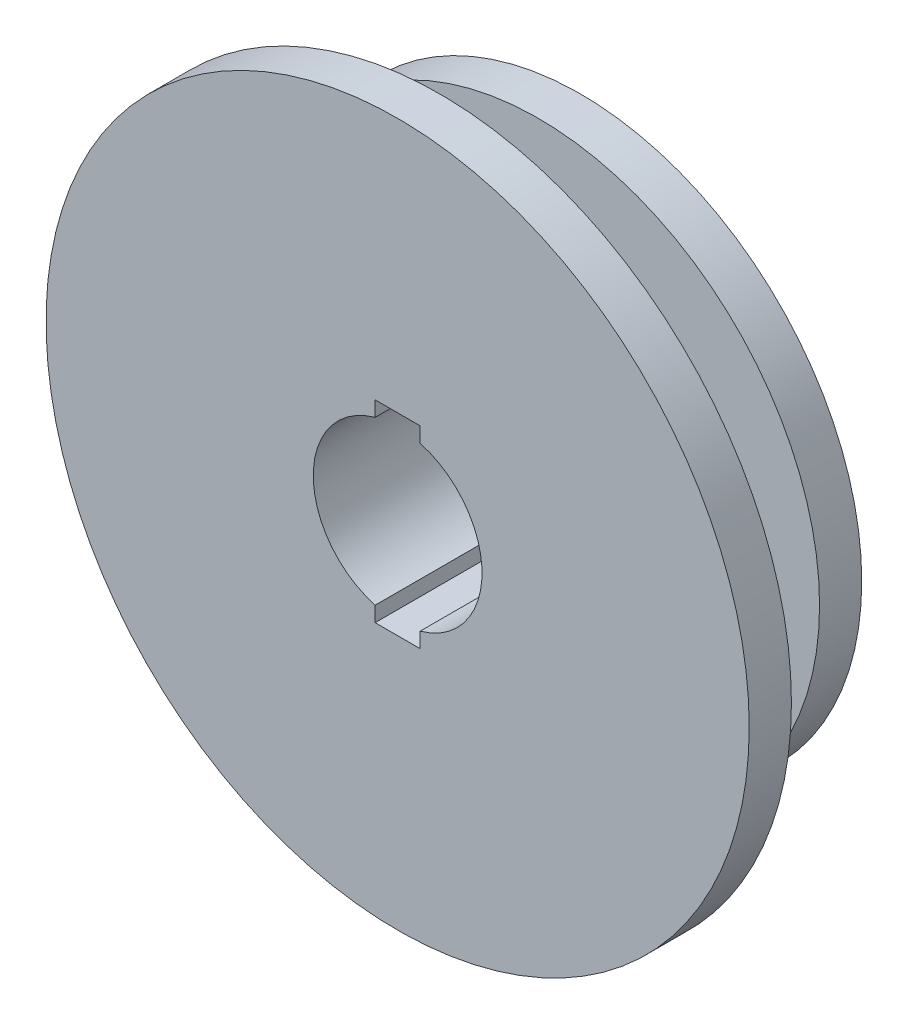
ISO-10303-21;
HEADER;
FILE_DESCRIPTION(('STEP AP214'),'2;1');
FILE_NAME('part.step','',(''),(''),'','','');
FILE_SCHEMA(('AUTOMOTIVE_DESIGN { 1 0 10303 214 1 1 1 1 }'));
ENDSEC;
DATA;
#1=APPLICATION_CONTEXT('core data for automotive mechanical design processes');
#2=APPLICATION_PROTOCOL_DEFINITION('international standard','automotive_design',2000,#1);
#3=PRODUCT_CONTEXT('',#1,'mechanical');
#4=PRODUCT('Part','Part','',(#3));
#5=PRODUCT_RELATED_PRODUCT_CATEGORY('part','',(#4));
#6=PRODUCT_DEFINITION_FORMATION('','',#4);
#7=PRODUCT_DEFINITION_CONTEXT('part definition',#1,'design');
#8=PRODUCT_DEFINITION('design','',#6,#7);
#9=PRODUCT_DEFINITION_SHAPE('','',#8);
#10=(LENGTH_UNIT() NAMED_UNIT(*) SI_UNIT(.MILLI.,.METRE.));
#11=(NAMED_UNIT(*) PLANE_ANGLE_UNIT() SI_UNIT($,.RADIAN.));
#12=(NAMED_UNIT(*) SI_UNIT($,.STERADIAN.) SOLID_ANGLE_UNIT());
#13=UNCERTAINTY_MEASURE_WITH_UNIT(LENGTH_MEASURE(1.E-05),#10,'distance_accuracy_value','');
#14=(GEOMETRIC_REPRESENTATION_CONTEXT(3) GLOBAL_UNCERTAINTY_ASSIGNED_CONTEXT((#13)) GLOBAL_UNIT_ASSIGNED_CONTEXT((#10,
#11,#12)) REPRESENTATION_CONTEXT('',''));
#15=CARTESIAN_POINT('',(0.,0.,0.));
#16=DIRECTION('',(0.,0.,1.));
#17=DIRECTION('',(1.,0.,0.));
#18=AXIS2_PLACEMENT_3D('',#15,#16,#17);
#19=CARTESIAN_POINT('',(0.,5.82449601570734,0.));
#20=DIRECTION('',(0.,0.,1.));
#21=DIRECTION('',(1.,0.,0.));
#22=AXIS2_PLACEMENT_3D('',#19,#20,#21);
#23=CYLINDRICAL_SURFACE('',#22,60.);
#24=DIRECTION('',(0.,0.,1.));
#25=VECTOR('',#24,1.);
#26=CARTESIAN_POINT('',(-16.,-52.0028331634965,-101.826733880455));
#27=LINE('',#26,#25);
#28=CARTESIAN_POINT('',(-16.,-52.0028331634965,-68.0578702566636));
#29=VERTEX_POINT('',#28);
#30=CARTESIAN_POINT('',(-16.,-52.0028331634965,31.9421297433364));
#31=VERTEX_POINT('',#30);
#32=EDGE_CURVE('E130',#29,#31,#27,.T.);
#33=ORIENTED_EDGE('',*,*,#32,.F.);
#34=CARTESIAN_POINT('',(0.,5.82449601570734,-68.0578702566636));
#35=DIRECTION('',(0.,0.,1.));
#36=DIRECTION('',(1.,0.,0.));
#37=AXIS2_PLACEMENT_3D('',#34,#35,#36);
#38=CIRCLE('',#37,60.);
#39=CARTESIAN_POINT('',(-16.,63.6518251949112,-68.0578702566636));
#40=VERTEX_POINT('',#39);
#41=EDGE_CURVE('E118',#40,#29,#38,.T.);
#42=ORIENTED_EDGE('',*,*,#41,.F.);
#43=DIRECTION('',(0.,0.,1.));
#44=VECTOR('',#43,1.);
#45=CARTESIAN_POINT('',(-16.,63.6518251949112,-101.826733880455));
#46=LINE('',#45,#44);
#47=CARTESIAN_POINT('',(-16.,63.6518251949112,31.9421297433364));
#48=VERTEX_POINT('',#47);
#49=EDGE_CURVE('E56',#40,#48,#46,.T.);
#50=ORIENTED_EDGE('',*,*,#49,.T.);
#51=CARTESIAN_POINT('',(0.,5.82449601570734,31.9421297433364));
#52=DIRECTION('',(0.,0.,1.));
#53=DIRECTION('',(1.,0.,0.));
#54=AXIS2_PLACEMENT_3D('',#51,#52,#53);
#55=CIRCLE('',#54,60.);
#56=EDGE_CURVE('E11',#48,#31,#55,.T.);
#57=ORIENTED_EDGE('',*,*,#56,.T.);
#58=EDGE_LOOP('',(#33,#42,#50,#57));
#59=FACE_BOUND('',#58,.T.);
#60=ADVANCED_FACE('F33',(#59),#23,.F.);
#61=CARTESIAN_POINT('',(16.,-52.0028331634965,-68.0578702566636));
#62=VERTEX_POINT('',#61);
#63=CARTESIAN_POINT('',(16.,63.6518251949112,-68.0578702566636));
#64=VERTEX_POINT('',#63);
#65=EDGE_CURVE('E150',#62,#64,#38,.T.);
#66=ORIENTED_EDGE('',*,*,#65,.F.);
#67=DIRECTION('',(0.,0.,1.));
#68=VECTOR('',#67,1.);
#69=CARTESIAN_POINT('',(16.,-52.0028331634965,-101.826733880455));
#70=LINE('',#69,#68);
#71=CARTESIAN_POINT('',(16.,-52.0028331634965,31.9421297433364));
#72=VERTEX_POINT('',#71);
#73=EDGE_CURVE('E48',#62,#72,#70,.T.);
#74=ORIENTED_EDGE('',*,*,#73,.T.);
#75=CARTESIAN_POINT('',(16.,63.6518251949112,31.9421297433364));
#76=VERTEX_POINT('',#75);
#77=EDGE_CURVE('E41',#72,#76,#55,.T.);
#78=ORIENTED_EDGE('',*,*,#77,.T.);
#79=DIRECTION('',(0.,0.,1.));
#80=VECTOR('',#79,1.);
#81=CARTESIAN_POINT('',(16.,63.6518251949112,-101.826733880455));
#82=LINE('',#81,#80);
#83=EDGE_CURVE('E119',#64,#76,#82,.T.);
#84=ORIENTED_EDGE('',*,*,#83,.F.);
#85=EDGE_LOOP('',(#66,#74,#78,#84));
#86=FACE_BOUND('',#85,.T.);
#87=ADVANCED_FACE('F35',(#86),#23,.F.);
#88=CARTESIAN_POINT('',(0.,65.8244960157073,31.9421297433364));
#89=DIRECTION('',(0.,0.,-1.));
#90=DIRECTION('',(-1.,0.,0.));
#91=AXIS2_PLACEMENT_3D('',#88,#89,#90);
#92=PLANE('',#91);
#93=ORIENTED_EDGE('',*,*,#77,.F.);
#94=DIRECTION('',(0.,1.,0.));
#95=VECTOR('',#94,1.);
#96=CARTESIAN_POINT('',(16.,11.6489920314147,31.9421297433364));
#97=LINE('',#96,#95);
#98=CARTESIAN_POINT('',(16.,-62.788756881113,31.9421297433364));
#99=VERTEX_POINT('',#98);
#100=EDGE_CURVE('E120',#99,#72,#97,.T.);
#101=ORIENTED_EDGE('',*,*,#100,.F.);
#102=DIRECTION('',(1.,0.,0.));
#103=VECTOR('',#102,1.);
#104=CARTESIAN_POINT('',(0.,-62.788756881113,31.9421297433364));
#105=LINE('',#104,#103);
#106=CARTESIAN_POINT('',(-16.,-62.788756881113,31.9421297433364));
#107=VERTEX_POINT('',#106);
#108=EDGE_CURVE('E200',#107,#99,#105,.T.);
#109=ORIENTED_EDGE('',*,*,#108,.F.);
#110=DIRECTION('',(0.,1.,0.));
#111=VECTOR('',#110,1.);
#112=CARTESIAN_POINT('',(-16.,11.6489920314147,31.9421297433364));
#113=LINE('',#112,#111);
#114=EDGE_CURVE('E105',#107,#31,#113,.T.);
#115=ORIENTED_EDGE('',*,*,#114,.T.);
#116=ORIENTED_EDGE('',*,*,#56,.F.);
#117=DIRECTION('',(0.,-1.,0.));
#118=VECTOR('',#117,1.);
#119=CARTESIAN_POINT('',(-16.,0.,31.9421297433364));
#120=LINE('',#119,#118);
#121=CARTESIAN_POINT('',(-16.,74.4377489125277,31.9421297433364));
#122=VERTEX_POINT('',#121);
#123=EDGE_CURVE('E133',#122,#48,#120,.T.);
#124=ORIENTED_EDGE('',*,*,#123,.F.);
#125=DIRECTION('',(-1.,0.,0.));
#126=VECTOR('',#125,1.);
#127=CARTESIAN_POINT('',(0.,74.4377489125277,31.9421297433364));
#128=LINE('',#127,#126);
#129=CARTESIAN_POINT('',(16.,74.4377489125277,31.9421297433364));
#130=VERTEX_POINT('',#129);
#131=EDGE_CURVE('E136',#130,#122,#128,.T.);
#132=ORIENTED_EDGE('',*,*,#131,.F.);
#133=DIRECTION('',(0.,-1.,0.));
#134=VECTOR('',#133,1.);
#135=CARTESIAN_POINT('',(16.,0.,31.9421297433364));
#136=LINE('',#135,#134);
#137=EDGE_CURVE('E139',#130,#76,#136,.T.);
#138=ORIENTED_EDGE('',*,*,#137,.T.);
#139=EDGE_LOOP('',(#93,#101,#109,#115,#116,#124,#132,#138));
#140=FACE_BOUND('',#139,.T.);
#141=CARTESIAN_POINT('',(0.,5.82449601570734,31.9421297433364));
#142=DIRECTION('',(0.,0.,1.));
#143=DIRECTION('',(1.,0.,0.));
#144=AXIS2_PLACEMENT_3D('',#141,#142,#143);
#145=CIRCLE('',#144,250.);
#146=CARTESIAN_POINT('',(250.,5.82449601570734,31.9421297433364));
#147=VERTEX_POINT('',#146);
#148=EDGE_CURVE('E177',#147,#147,#145,.T.);
#149=ORIENTED_EDGE('',*,*,#148,.T.);
#150=EDGE_LOOP('',(#149));
#151=FACE_BOUND('',#150,.T.);
#152=ADVANCED_FACE('F192',(#140,#151),#92,.F.);
#153=CARTESIAN_POINT('',(0.,5.82449601570734,0.));
#154=DIRECTION('',(0.,0.,1.));
#155=DIRECTION('',(1.,0.,0.));
#156=AXIS2_PLACEMENT_3D('',#153,#154,#155);
#157=CYLINDRICAL_SURFACE('',#156,250.);
#158=ORIENTED_EDGE('',*,*,#148,.F.);
#159=EDGE_LOOP('',(#158));
#160=FACE_BOUND('',#159,.T.);
#161=CARTESIAN_POINT('',(0.,5.82449601570734,1.94212974333642));
#162=DIRECTION('',(0.,0.,1.));
#163=DIRECTION('',(1.,0.,0.));
#164=AXIS2_PLACEMENT_3D('',#161,#162,#163);
#165=CIRCLE('',#164,250.);
#166=CARTESIAN_POINT('',(250.,5.82449601570734,1.94212974333642));
#167=VERTEX_POINT('',#166);
#168=EDGE_CURVE('E175',#167,#167,#165,.T.);
#169=ORIENTED_EDGE('',*,*,#168,.T.);
#170=EDGE_LOOP('',(#169));
#171=FACE_BOUND('',#170,.T.);
#172=ADVANCED_FACE('F210',(#160,#171),#157,.T.);
#173=CARTESIAN_POINT('',(0.,255.824496015707,1.94212974333641));
#174=DIRECTION('',(0.,0.,1.));
#175=DIRECTION('',(1.,0.,0.));
#176=AXIS2_PLACEMENT_3D('',#173,#174,#175);
#177=PLANE('',#176);
#178=ORIENTED_EDGE('',*,*,#168,.F.);
#179=EDGE_LOOP('',(#178));
#180=FACE_BOUND('',#179,.T.);
#181=CARTESIAN_POINT('',(0.,5.82449601570734,1.9421297433364));
#182=DIRECTION('',(0.,0.,1.));
#183=DIRECTION('',(1.,0.,0.));
#184=AXIS2_PLACEMENT_3D('',#181,#182,#183);
#185=CIRCLE('',#184,90.);
#186=CARTESIAN_POINT('',(90.,5.82449601570734,1.9421297433364));
#187=VERTEX_POINT('',#186);
#188=EDGE_CURVE('E172',#187,#187,#185,.T.);
#189=ORIENTED_EDGE('',*,*,#188,.T.);
#190=EDGE_LOOP('',(#189));
#191=FACE_BOUND('',#190,.T.);
#192=ADVANCED_FACE('F214',(#180,#191),#177,.F.);
#193=CARTESIAN_POINT('',(0.,5.82449601570734,0.));
#194=DIRECTION('',(0.,0.,1.));
#195=DIRECTION('',(1.,0.,0.));
#196=AXIS2_PLACEMENT_3D('',#193,#194,#195);
#197=CYLINDRICAL_SURFACE('',#196,90.);
#198=ORIENTED_EDGE('',*,*,#188,.F.);
#199=EDGE_LOOP('',(#198));
#200=FACE_BOUND('',#199,.T.);
#201=CARTESIAN_POINT('',(0.,5.82449601570734,-68.0578702566636));
#202=DIRECTION('',(0.,0.,1.));
#203=DIRECTION('',(1.,0.,0.));
#204=AXIS2_PLACEMENT_3D('',#201,#202,#203);
#205=CIRCLE('',#204,90.);
#206=CARTESIAN_POINT('',(90.,5.82449601570734,-68.0578702566636));
#207=VERTEX_POINT('',#206);
#208=EDGE_CURVE('E169',#207,#207,#205,.T.);
#209=ORIENTED_EDGE('',*,*,#208,.T.);
#210=EDGE_LOOP('',(#209));
#211=FACE_BOUND('',#210,.T.);
#212=ADVANCED_FACE('F220',(#200,#211),#197,.T.);
#213=CARTESIAN_POINT('',(0.,95.8244960157074,-68.0578702566636));
#214=DIRECTION('',(0.,0.,-1.));
#215=DIRECTION('',(-1.,0.,0.));
#216=AXIS2_PLACEMENT_3D('',#213,#214,#215);
#217=PLANE('',#216);
#218=ORIENTED_EDGE('',*,*,#208,.F.);
#219=EDGE_LOOP('',(#218));
#220=FACE_BOUND('',#219,.T.);
#221=CARTESIAN_POINT('',(0.,5.82449601570734,-68.0578702566636));
#222=DIRECTION('',(0.,0.,1.));
#223=DIRECTION('',(1.,0.,0.));
#224=AXIS2_PLACEMENT_3D('',#221,#222,#223);
#225=CIRCLE('',#224,200.);
#226=CARTESIAN_POINT('',(200.,5.82449601570734,-68.0578702566636));
#227=VERTEX_POINT('',#226);
#228=EDGE_CURVE('E166',#227,#227,#225,.T.);
#229=ORIENTED_EDGE('',*,*,#228,.T.);
#230=EDGE_LOOP('',(#229));
#231=FACE_BOUND('',#230,.T.);
#232=ADVANCED_FACE('F224',(#220,#231),#217,.F.);
#233=CARTESIAN_POINT('',(0.,5.82449601570734,0.));
#234=DIRECTION('',(0.,0.,1.));
#235=DIRECTION('',(1.,0.,0.));
#236=AXIS2_PLACEMENT_3D('',#233,#234,#235);
#237=CYLINDRICAL_SURFACE('',#236,200.);
#238=ORIENTED_EDGE('',*,*,#228,.F.);
#239=EDGE_LOOP('',(#238));
#240=FACE_BOUND('',#239,.T.);
#241=CARTESIAN_POINT('',(0.,5.82449601570734,-98.0578702566636));
#242=DIRECTION('',(0.,0.,1.));
#243=DIRECTION('',(1.,0.,0.));
#244=AXIS2_PLACEMENT_3D('',#241,#242,#243);
#245=CIRCLE('',#244,200.);
#246=CARTESIAN_POINT('',(200.,5.82449601570734,-98.0578702566636));
#247=VERTEX_POINT('',#246);
#248=EDGE_CURVE('E163',#247,#247,#245,.T.);
#249=ORIENTED_EDGE('',*,*,#248,.T.);
#250=EDGE_LOOP('',(#249));
#251=FACE_BOUND('',#250,.T.);
#252=ADVANCED_FACE('F228',(#240,#251),#237,.T.);
#253=CARTESIAN_POINT('',(0.,205.824496015707,-98.0578702566636));
#254=DIRECTION('',(0.,0.,1.));
#255=DIRECTION('',(1.,0.,0.));
#256=AXIS2_PLACEMENT_3D('',#253,#254,#255);
#257=PLANE('',#256);
#258=ORIENTED_EDGE('',*,*,#248,.F.);
#259=EDGE_LOOP('',(#258));
#260=FACE_BOUND('',#259,.T.);
#261=CARTESIAN_POINT('',(0.,5.82449601570734,-98.0578702566636));
#262=DIRECTION('',(0.,0.,1.));
#263=DIRECTION('',(1.,0.,0.));
#264=AXIS2_PLACEMENT_3D('',#261,#262,#263);
#265=CIRCLE('',#264,30.);
#266=CARTESIAN_POINT('',(30.,5.82449601570734,-98.0578702566636));
#267=VERTEX_POINT('',#266);
#268=EDGE_CURVE('E160',#267,#267,#265,.T.);
#269=ORIENTED_EDGE('',*,*,#268,.T.);
#270=EDGE_LOOP('',(#269));
#271=FACE_BOUND('',#270,.T.);
#272=ADVANCED_FACE('F232',(#260,#271),#257,.F.);
#273=CARTESIAN_POINT('',(0.,5.82449601570734,0.));
#274=DIRECTION('',(0.,0.,1.));
#275=DIRECTION('',(1.,0.,0.));
#276=AXIS2_PLACEMENT_3D('',#273,#274,#275);
#277=CYLINDRICAL_SURFACE('',#276,30.);
#278=ORIENTED_EDGE('',*,*,#268,.F.);
#279=EDGE_LOOP('',(#278));
#280=FACE_BOUND('',#279,.T.);
#281=CARTESIAN_POINT('',(0.,5.82449601570734,-68.0578702566636));
#282=DIRECTION('',(0.,0.,1.));
#283=DIRECTION('',(1.,0.,0.));
#284=AXIS2_PLACEMENT_3D('',#281,#282,#283);
#285=CIRCLE('',#284,30.);
#286=CARTESIAN_POINT('',(30.,5.82449601570734,-68.0578702566636));
#287=VERTEX_POINT('',#286);
#288=EDGE_CURVE('E157',#287,#287,#285,.T.);
#289=ORIENTED_EDGE('',*,*,#288,.T.);
#290=EDGE_LOOP('',(#289));
#291=FACE_BOUND('',#290,.T.);
#292=ADVANCED_FACE('F236',(#280,#291),#277,.F.);
#293=CARTESIAN_POINT('',(0.,65.8244960157073,-68.0578702566636));
#294=DIRECTION('',(0.,0.,-1.));
#295=DIRECTION('',(-1.,0.,0.));
#296=AXIS2_PLACEMENT_3D('',#293,#294,#295);
#297=PLANE('',#296);
#298=ORIENTED_EDGE('',*,*,#288,.F.);
#299=EDGE_LOOP('',(#298));
#300=FACE_BOUND('',#299,.T.);
#301=ORIENTED_EDGE('',*,*,#41,.T.);
#302=DIRECTION('',(0.,1.,0.));
#303=VECTOR('',#302,1.);
#304=CARTESIAN_POINT('',(-16.,11.6489920314147,-68.0578702566636));
#305=LINE('',#304,#303);
#306=CARTESIAN_POINT('',(-16.,-62.788756881113,-68.0578702566636));
#307=VERTEX_POINT('',#306);
#308=EDGE_CURVE('E102',#307,#29,#305,.T.);
#309=ORIENTED_EDGE('',*,*,#308,.F.);
#310=DIRECTION('',(1.,0.,0.));
#311=VECTOR('',#310,1.);
#312=CARTESIAN_POINT('',(0.,-62.788756881113,-68.0578702566636));
#313=LINE('',#312,#311);
#314=CARTESIAN_POINT('',(16.,-62.788756881113,-68.0578702566636));
#315=VERTEX_POINT('',#314);
#316=EDGE_CURVE('E115',#307,#315,#313,.T.);
#317=ORIENTED_EDGE('',*,*,#316,.T.);
#318=DIRECTION('',(0.,1.,0.));
#319=VECTOR('',#318,1.);
#320=CARTESIAN_POINT('',(16.,11.6489920314147,-68.0578702566636));
#321=LINE('',#320,#319);
#322=EDGE_CURVE('E125',#315,#62,#321,.T.);
#323=ORIENTED_EDGE('',*,*,#322,.T.);
#324=ORIENTED_EDGE('',*,*,#65,.T.);
#325=DIRECTION('',(0.,-1.,0.));
#326=VECTOR('',#325,1.);
#327=CARTESIAN_POINT('',(16.,0.,-68.0578702566636));
#328=LINE('',#327,#326);
#329=CARTESIAN_POINT('',(16.,74.4377489125277,-68.0578702566636));
#330=VERTEX_POINT('',#329);
#331=EDGE_CURVE('E135',#330,#64,#328,.T.);
#332=ORIENTED_EDGE('',*,*,#331,.F.);
#333=DIRECTION('',(-1.,0.,0.));
#334=VECTOR('',#333,1.);
#335=CARTESIAN_POINT('',(0.,74.4377489125277,-68.0578702566636));
#336=LINE('',#335,#334);
#337=CARTESIAN_POINT('',(-16.,74.4377489125277,-68.0578702566636));
#338=VERTEX_POINT('',#337);
#339=EDGE_CURVE('E143',#330,#338,#336,.T.);
#340=ORIENTED_EDGE('',*,*,#339,.T.);
#341=DIRECTION('',(0.,-1.,0.));
#342=VECTOR('',#341,1.);
#343=CARTESIAN_POINT('',(-16.,0.,-68.0578702566636));
#344=LINE('',#343,#342);
#345=EDGE_CURVE('E146',#338,#40,#344,.T.);
#346=ORIENTED_EDGE('',*,*,#345,.T.);
#347=EDGE_LOOP('',(#301,#309,#317,#323,#324,#332,#340,#346));
#348=FACE_BOUND('',#347,.T.);
#349=ADVANCED_FACE('F114',(#300,#348),#297,.F.);
#350=CARTESIAN_POINT('',(-16.,0.,-101.826733880455));
#351=DIRECTION('',(-1.,0.,0.));
#352=DIRECTION('',(0.,0.,1.));
#353=AXIS2_PLACEMENT_3D('',#350,#351,#352);
#354=PLANE('',#353);
#355=DIRECTION('',(0.,0.,1.));
#356=VECTOR('',#355,1.);
#357=CARTESIAN_POINT('',(-16.,74.4377489125277,-101.826733880455));
#358=LINE('',#357,#356);
#359=EDGE_CURVE('E145',#338,#122,#358,.T.);
#360=ORIENTED_EDGE('',*,*,#359,.T.);
#361=ORIENTED_EDGE('',*,*,#123,.T.);
#362=ORIENTED_EDGE('',*,*,#49,.F.);
#363=ORIENTED_EDGE('',*,*,#345,.F.);
#364=EDGE_LOOP('',(#360,#361,#362,#363));
#365=FACE_BOUND('',#364,.T.);
#366=ADVANCED_FACE('F243',(#365),#354,.F.);
#367=CARTESIAN_POINT('',(0.,74.4377489125277,-101.826733880455));
#368=DIRECTION('',(0.,1.,0.));
#369=DIRECTION('',(0.,0.,1.));
#370=AXIS2_PLACEMENT_3D('',#367,#368,#369);
#371=PLANE('',#370);
#372=DIRECTION('',(0.,0.,1.));
#373=VECTOR('',#372,1.);
#374=CARTESIAN_POINT('',(16.,74.4377489125277,-101.826733880455));
#375=LINE('',#374,#373);
#376=EDGE_CURVE('E142',#330,#130,#375,.T.);
#377=ORIENTED_EDGE('',*,*,#376,.T.);
#378=ORIENTED_EDGE('',*,*,#131,.T.);
#379=ORIENTED_EDGE('',*,*,#359,.F.);
#380=ORIENTED_EDGE('',*,*,#339,.F.);
#381=EDGE_LOOP('',(#377,#378,#379,#380));
#382=FACE_BOUND('',#381,.T.);
#383=ADVANCED_FACE('F197',(#382),#371,.F.);
#384=CARTESIAN_POINT('',(16.,0.,-101.826733880455));
#385=DIRECTION('',(-1.,0.,0.));
#386=DIRECTION('',(0.,0.,1.));
#387=AXIS2_PLACEMENT_3D('',#384,#385,#386);
#388=PLANE('',#387);
#389=ORIENTED_EDGE('',*,*,#331,.T.);
#390=ORIENTED_EDGE('',*,*,#83,.T.);
#391=ORIENTED_EDGE('',*,*,#137,.F.);
#392=ORIENTED_EDGE('',*,*,#376,.F.);
#393=EDGE_LOOP('',(#389,#390,#391,#392));
#394=FACE_BOUND('',#393,.T.);
#395=ADVANCED_FACE('F189',(#394),#388,.T.);
#396=CARTESIAN_POINT('',(16.,11.6489920314147,-101.826733880455));
#397=DIRECTION('',(1.,0.,0.));
#398=DIRECTION('',(0.,0.,-1.));
#399=AXIS2_PLACEMENT_3D('',#396,#397,#398);
#400=PLANE('',#399);
#401=DIRECTION('',(0.,0.,1.));
#402=VECTOR('',#401,1.);
#403=CARTESIAN_POINT('',(16.,-62.788756881113,-101.826733880455));
#404=LINE('',#403,#402);
#405=EDGE_CURVE('E110',#315,#99,#404,.T.);
#406=ORIENTED_EDGE('',*,*,#405,.T.);
#407=ORIENTED_EDGE('',*,*,#100,.T.);
#408=ORIENTED_EDGE('',*,*,#73,.F.);
#409=ORIENTED_EDGE('',*,*,#322,.F.);
#410=EDGE_LOOP('',(#406,#407,#408,#409));
#411=FACE_BOUND('',#410,.T.);
#412=ADVANCED_FACE('F199',(#411),#400,.F.);
#413=CARTESIAN_POINT('',(0.,-62.788756881113,-101.826733880455));
#414=DIRECTION('',(0.,-1.,0.));
#415=DIRECTION('',(0.,0.,-1.));
#416=AXIS2_PLACEMENT_3D('',#413,#414,#415);
#417=PLANE('',#416);
#418=DIRECTION('',(0.,0.,1.));
#419=VECTOR('',#418,1.);
#420=CARTESIAN_POINT('',(-16.,-62.788756881113,-101.826733880455));
#421=LINE('',#420,#419);
#422=EDGE_CURVE('E99',#307,#107,#421,.T.);
#423=ORIENTED_EDGE('',*,*,#422,.T.);
#424=ORIENTED_EDGE('',*,*,#108,.T.);
#425=ORIENTED_EDGE('',*,*,#405,.F.);
#426=ORIENTED_EDGE('',*,*,#316,.F.);
#427=EDGE_LOOP('',(#423,#424,#425,#426));
#428=FACE_BOUND('',#427,.T.);
#429=ADVANCED_FACE('F122',(#428),#417,.F.);
#430=CARTESIAN_POINT('',(-16.,11.6489920314147,-101.826733880455));
#431=DIRECTION('',(1.,0.,0.));
#432=DIRECTION('',(0.,0.,-1.));
#433=AXIS2_PLACEMENT_3D('',#430,#431,#432);
#434=PLANE('',#433);
#435=ORIENTED_EDGE('',*,*,#308,.T.);
#436=ORIENTED_EDGE('',*,*,#32,.T.);
#437=ORIENTED_EDGE('',*,*,#114,.F.);
#438=ORIENTED_EDGE('',*,*,#422,.F.);
#439=EDGE_LOOP('',(#435,#436,#437,#438));
#440=FACE_BOUND('',#439,.T.);
#441=ADVANCED_FACE('F101',(#440),#434,.T.);
#442=CLOSED_SHELL('',(#60,#87,#152,#172,#192,#212,#232,#252,#272,#292,#349,#366,#383,#395,#412,
#429,#441));
#443=MANIFOLD_SOLID_BREP('B2',#442);
#444=ADVANCED_BREP_SHAPE_REPRESENTATION('',(#18,#443),#14);
#445=SHAPE_DEFINITION_REPRESENTATION(#9,#444);
ENDSEC;
END-ISO-10303-21;
